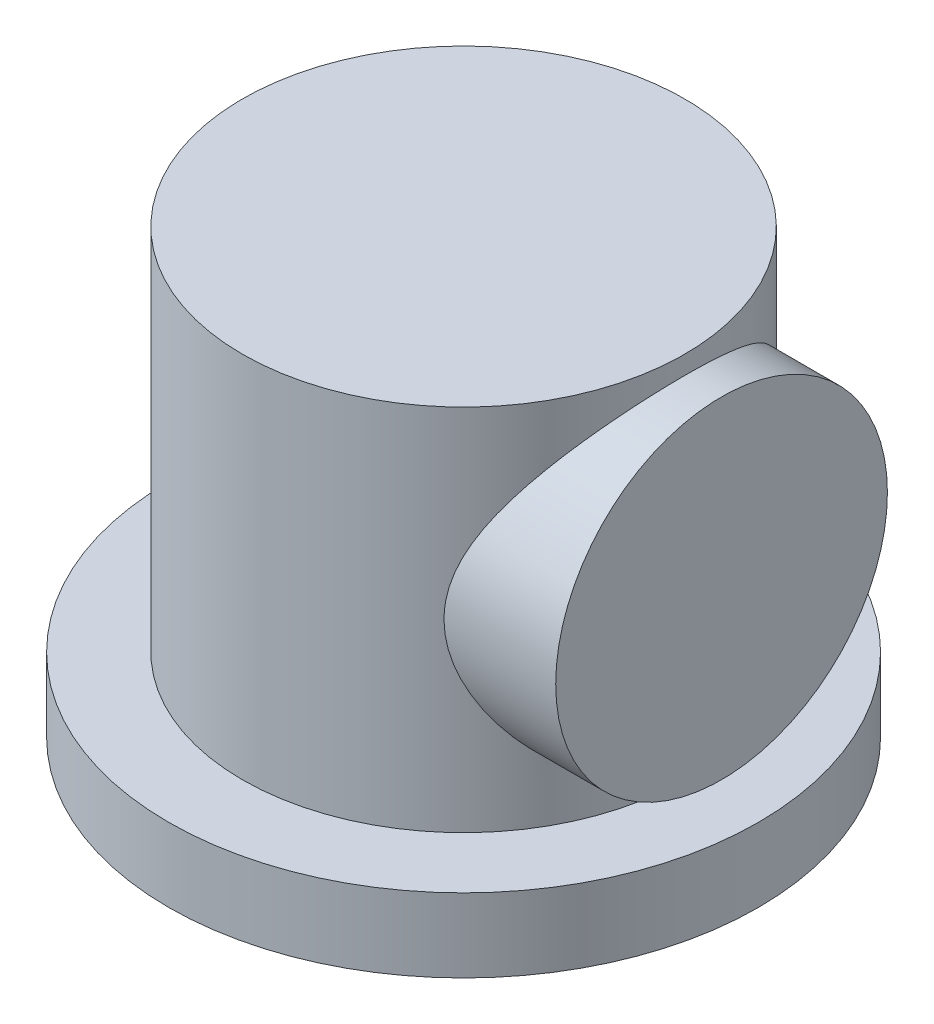
ISO-10303-21;
HEADER;
FILE_DESCRIPTION(('STEP AP214'),'2;1');
FILE_NAME('part.step','',(''),(''),'','','');
FILE_SCHEMA(('AUTOMOTIVE_DESIGN { 1 0 10303 214 1 1 1 1 }'));
ENDSEC;
DATA;
#1=APPLICATION_CONTEXT('core data for automotive mechanical design processes');
#2=APPLICATION_PROTOCOL_DEFINITION('international standard','automotive_design',2000,#1);
#3=PRODUCT_CONTEXT('',#1,'mechanical');
#4=PRODUCT('Part','Part','',(#3));
#5=PRODUCT_RELATED_PRODUCT_CATEGORY('part','',(#4));
#6=PRODUCT_DEFINITION_FORMATION('','',#4);
#7=PRODUCT_DEFINITION_CONTEXT('part definition',#1,'design');
#8=PRODUCT_DEFINITION('design','',#6,#7);
#9=PRODUCT_DEFINITION_SHAPE('','',#8);
#10=(LENGTH_UNIT() NAMED_UNIT(*) SI_UNIT(.MILLI.,.METRE.));
#11=(NAMED_UNIT(*) PLANE_ANGLE_UNIT() SI_UNIT($,.RADIAN.));
#12=(NAMED_UNIT(*) SI_UNIT($,.STERADIAN.) SOLID_ANGLE_UNIT());
#13=UNCERTAINTY_MEASURE_WITH_UNIT(LENGTH_MEASURE(1.E-05),#10,'distance_accuracy_value','');
#14=(GEOMETRIC_REPRESENTATION_CONTEXT(3) GLOBAL_UNCERTAINTY_ASSIGNED_CONTEXT((#13)) GLOBAL_UNIT_ASSIGNED_CONTEXT((#10,
#11,#12)) REPRESENTATION_CONTEXT('',''));
#15=CARTESIAN_POINT('',(0.,0.,0.));
#16=DIRECTION('',(0.,0.,1.));
#17=DIRECTION('',(1.,0.,0.));
#18=AXIS2_PLACEMENT_3D('',#15,#16,#17);
#19=CARTESIAN_POINT('',(0.,76.2,0.));
#20=DIRECTION('',(0.,-1.,0.));
#21=DIRECTION('',(0.,0.,-1.));
#22=AXIS2_PLACEMENT_3D('',#19,#20,#21);
#23=CYLINDRICAL_SURFACE('',#22,38.1);
#24=CARTESIAN_POINT('',(0.,76.2,0.));
#25=DIRECTION('',(0.,1.,0.));
#26=DIRECTION('',(0.,0.,1.));
#27=AXIS2_PLACEMENT_3D('',#24,#25,#26);
#28=CIRCLE('',#27,38.1);
#29=CARTESIAN_POINT('',(0.,76.2,38.1));
#30=VERTEX_POINT('',#29);
#31=EDGE_CURVE('E55',#30,#30,#28,.T.);
#32=ORIENTED_EDGE('',*,*,#31,.F.);
#33=EDGE_LOOP('',(#32));
#34=FACE_BOUND('',#33,.T.);
#35=CARTESIAN_POINT('',(0.,12.7,0.));
#36=DIRECTION('',(0.,1.,0.));
#37=DIRECTION('',(0.,0.,1.));
#38=AXIS2_PLACEMENT_3D('',#35,#36,#37);
#39=CIRCLE('',#38,38.1);
#40=CARTESIAN_POINT('',(0.,12.7,38.1));
#41=VERTEX_POINT('',#40);
#42=EDGE_CURVE('E43',#41,#41,#39,.T.);
#43=ORIENTED_EDGE('',*,*,#42,.T.);
#44=EDGE_LOOP('',(#43));
#45=FACE_BOUND('',#44,.T.);
#46=CARTESIAN_POINT('',(25.2007812378902,44.45,28.575));
#47=CARTESIAN_POINT('',(25.2008006671409,43.7830980894137,28.5749906044805));
#48=CARTESIAN_POINT('',(25.227408448482,43.1160504750004,28.5515850524145));
#49=CARTESIAN_POINT('',(25.3322147950642,41.7892026037153,28.458628921137));
#50=CARTESIAN_POINT('',(25.4104305730004,41.1294048395383,28.3890629461029));
#51=CARTESIAN_POINT('',(25.6140600755985,39.8219380686883,28.2054717153486));
#52=CARTESIAN_POINT('',(25.7395852830767,39.1743015337192,28.0913414224956));
#53=CARTESIAN_POINT('',(26.0313832344784,37.8971025459034,27.8211510872177));
#54=CARTESIAN_POINT('',(26.1976677884626,37.2675453907448,27.6650788908199));
#55=CARTESIAN_POINT('',(26.4708904185141,36.3435992164623,27.402875206737));
#56=CARTESIAN_POINT('',(26.5651796298396,36.0410910363347,27.311536282414));
#57=CARTESIAN_POINT('',(26.7610163164268,35.4415132303561,27.1196755900328));
#58=CARTESIAN_POINT('',(26.8625610863404,35.1444416287561,27.0191572408189));
#59=CARTESIAN_POINT('',(27.1768993304153,34.2614169479612,26.7041954914019));
#60=CARTESIAN_POINT('',(27.3994022547113,33.6836356591392,26.4763401576649));
#61=CARTESIAN_POINT('',(27.8639216060738,32.5510281620977,25.9870283566228));
#62=CARTESIAN_POINT('',(28.1059314529202,31.996194307849,25.7255832025565));
#63=CARTESIAN_POINT('',(28.6040760158201,30.9094323185685,25.1705370121982));
#64=CARTESIAN_POINT('',(28.8602117558184,30.3775058490164,24.8769336433261));
#65=CARTESIAN_POINT('',(29.4363988945169,29.2276774439548,24.1939571622755));
#66=CARTESIAN_POINT('',(29.7585993568103,28.6151081581173,23.7974062407674));
#67=CARTESIAN_POINT('',(30.4090601561974,27.4241287463294,22.9604032544577));
#68=CARTESIAN_POINT('',(30.7373209899645,26.8457214365579,22.5199475783428));
#69=CARTESIAN_POINT('',(31.3937545345196,25.7231205020728,21.5954630489136));
#70=CARTESIAN_POINT('',(31.721926474217,25.1789760639336,21.1113738748122));
#71=CARTESIAN_POINT('',(32.3716808774726,24.1271733614063,20.1008754774065));
#72=CARTESIAN_POINT('',(32.6932627916492,23.6195181301891,19.5744627436374));
#73=CARTESIAN_POINT('',(33.3886679843566,22.5427942500873,18.3680608231992));
#74=CARTESIAN_POINT('',(33.7597234755502,21.9824014553537,17.6786819186663));
#75=CARTESIAN_POINT('',(34.4744224683798,20.9221512415051,16.240948491866));
#76=CARTESIAN_POINT('',(34.8180597996023,20.4223074358014,15.4925807691664));
#77=CARTESIAN_POINT('',(35.3052806236729,19.7232700666945,14.3291250333514));
#78=CARTESIAN_POINT('',(35.4628696732549,19.4988677664602,13.9348128159413));
#79=CARTESIAN_POINT('',(35.7676348392876,19.0675721259238,13.1327919340335));
#80=CARTESIAN_POINT('',(35.9148115905115,18.8606777181229,12.725084088407));
#81=CARTESIAN_POINT('',(36.1975011282807,18.465412737829,11.8971488411912));
#82=CARTESIAN_POINT('',(36.3330205609467,18.2770316016226,11.4769287595878));
#83=CARTESIAN_POINT('',(36.591386652846,17.9195371298192,10.6244474996037));
#84=CARTESIAN_POINT('',(36.7142302916224,17.7504283855541,10.1921834823495));
#85=CARTESIAN_POINT('',(36.9920391771516,17.3694772639004,9.14322050929647));
#86=CARTESIAN_POINT('',(37.1404683694886,17.167220637446,8.52125272848172));
#87=CARTESIAN_POINT('',(37.4076309332702,16.8046298428865,7.25914303206016));
#88=CARTESIAN_POINT('',(37.5263713869622,16.6442856761504,6.61900549149916));
#89=CARTESIAN_POINT('',(37.7317822532989,16.3676817121018,5.32462507705733));
#90=CARTESIAN_POINT('',(37.8184740717763,16.2513924884477,4.67039192807618));
#91=CARTESIAN_POINT('',(37.9580664020574,16.0644526077052,3.35182184474573));
#92=CARTESIAN_POINT('',(38.0109657025718,15.9938035865842,2.68748454908811));
#93=CARTESIAN_POINT('',(38.0818960471386,15.8991257178152,1.3518710468347));
#94=CARTESIAN_POINT('',(38.0998353574208,15.8752195211318,0.680581219013222));
#95=CARTESIAN_POINT('',(38.1001623818557,15.8747834931662,-0.662019585113726));
#96=CARTESIAN_POINT('',(38.0825502366907,15.8982534744097,-1.333330561325));
#97=CARTESIAN_POINT('',(38.0121671928184,15.9921988987437,-2.67091462091919));
#98=CARTESIAN_POINT('',(37.9593893441283,16.0626836336099,-3.33718668210466));
#99=CARTESIAN_POINT('',(37.8198364811661,16.2495653359708,-4.6596210134355));
#100=CARTESIAN_POINT('',(37.7330616925311,16.3659619987485,-5.31578335064894));
#101=CARTESIAN_POINT('',(37.5309020208181,16.6381817567608,-6.5912007013435));
#102=CARTESIAN_POINT('',(37.4166034046182,16.7925116750831,-7.21094899468921));
#103=CARTESIAN_POINT('',(37.160171322655,17.1404270179622,-8.43336854480208));
#104=CARTESIAN_POINT('',(37.0180386949086,17.3340112606693,-9.0360403150782));
#105=CARTESIAN_POINT('',(36.7083984634839,17.7582752021408,-10.2214897432997));
#106=CARTESIAN_POINT('',(36.5408885876569,17.9889582226536,-10.8042656141374));
#107=CARTESIAN_POINT('',(36.183199601535,18.4851368929411,-11.9475913883163));
#108=CARTESIAN_POINT('',(35.9930191498547,18.7506346027439,-12.5081399738835));
#109=CARTESIAN_POINT('',(35.571151295106,19.3447055761846,-13.6646224776035));
#110=CARTESIAN_POINT('',(35.3371993200098,19.6769954998992,-14.2578206141072));
#111=CARTESIAN_POINT('',(34.848864743216,20.3786999325388,-15.4129800377948));
#112=CARTESIAN_POINT('',(34.5944808958504,20.7481167053182,-15.9749394169088));
#113=CARTESIAN_POINT('',(34.0690818416613,21.5217712654444,-17.0667789463111));
#114=CARTESIAN_POINT('',(33.7980552583958,21.9260329496009,-17.5966366501525));
#115=CARTESIAN_POINT('',(33.2435454371908,22.7669684661831,-18.623023428057));
#116=CARTESIAN_POINT('',(32.9600616087754,23.2036438357015,-19.1195509194357));
#117=CARTESIAN_POINT('',(32.3280797016931,24.1966130786345,-20.1730776954288));
#118=CARTESIAN_POINT('',(31.9777641620642,24.7595376357236,-20.7227531516277));
#119=CARTESIAN_POINT('',(31.2723590801129,25.9271061891218,-21.7726808371495));
#120=CARTESIAN_POINT('',(30.9172686294436,26.5317582164321,-22.2729235071738));
#121=CARTESIAN_POINT('',(30.2100659592312,27.7816326102999,-23.2231089145585));
#122=CARTESIAN_POINT('',(29.8579554140302,28.4268762632745,-23.6730249110129));
#123=CARTESIAN_POINT('',(29.1658356330383,29.7568347447342,-24.52066856255));
#124=CARTESIAN_POINT('',(28.8258237062776,30.4415407061441,-24.9184078762976));
#125=CARTESIAN_POINT('',(28.2330584080281,31.7112403258947,-25.5863782679948));
#126=CARTESIAN_POINT('',(27.9763151422166,32.2892881082254,-25.8662897768244));
#127=CARTESIAN_POINT('',(27.4834916409928,33.4704295168007,-26.3893303191345));
#128=CARTESIAN_POINT('',(27.2474111712708,34.0735228589217,-26.6324597697351));
#129=CARTESIAN_POINT('',(26.8033817097847,35.3028834011413,-27.0792874467679));
#130=CARTESIAN_POINT('',(26.5953812416905,35.9291054407557,-27.2830581296517));
#131=CARTESIAN_POINT('',(26.2147449382644,37.2040962989309,-27.6489960172601));
#132=CARTESIAN_POINT('',(26.0420998844247,37.8528591884964,-27.8111740695632));
#133=CARTESIAN_POINT('',(25.7699617403444,39.0392964190427,-28.0632559394245));
#134=CARTESIAN_POINT('',(25.6627523563713,39.5735143773936,-28.1611130078221));
#135=CARTESIAN_POINT('',(25.4798439875616,40.6519446652572,-28.3267161168432));
#136=CARTESIAN_POINT('',(25.4041409692325,41.1961557061205,-28.3944660119079));
#137=CARTESIAN_POINT('',(25.2872757496332,42.2906909142761,-28.4985939420604));
#138=CARTESIAN_POINT('',(25.2460760717413,42.8410077892892,-28.5350060166583));
#139=CARTESIAN_POINT('',(25.1998268478469,43.9443714114327,-28.5758587892175));
#140=CARTESIAN_POINT('',(25.1947776736046,44.497418186578,-28.5802991583918));
#141=CARTESIAN_POINT('',(25.2210575813258,45.6021419430101,-28.5571102643138));
#142=CARTESIAN_POINT('',(25.2523986371663,46.1538184135396,-28.5294704453661));
#143=CARTESIAN_POINT('',(25.3501258083572,47.2515095528914,-28.4426676566597));
#144=CARTESIAN_POINT('',(25.4165119638612,47.7975242152258,-28.3835046507828));
#145=CARTESIAN_POINT('',(25.5817776566982,48.8811675230324,-28.2346413415518));
#146=CARTESIAN_POINT('',(25.6807046181691,49.4187827223068,-28.1448964620532));
#147=CARTESIAN_POINT('',(25.9074459324733,50.482116208448,-27.936318955934));
#148=CARTESIAN_POINT('',(26.0352643679854,51.007832802351,-27.8174822181209));
#149=CARTESIAN_POINT('',(26.3683068237936,52.2397000456342,-27.5025947417635));
#150=CARTESIAN_POINT('',(26.5845974013906,52.9397465155155,-27.2942911989163));
#151=CARTESIAN_POINT('',(27.0536964284258,54.3109773250914,-26.8293952509529));
#152=CARTESIAN_POINT('',(27.3065196233281,54.9821498679216,-26.5727833346621));
#153=CARTESIAN_POINT('',(27.8393177875196,56.295202175688,-26.014064987654));
#154=CARTESIAN_POINT('',(28.1193300724408,56.9370398524956,-25.711895708448));
#155=CARTESIAN_POINT('',(28.697672043654,58.1899353706702,-25.0647551327964));
#156=CARTESIAN_POINT('',(28.9960000742872,58.8009959850783,-24.719787702237));
#157=CARTESIAN_POINT('',(29.6144541218864,60.013351260662,-23.9757453989122));
#158=CARTESIAN_POINT('',(29.9349779962601,60.6135294170108,-23.5751846107589));
#159=CARTESIAN_POINT('',(30.5807447831745,61.7802790183083,-22.7312652262108));
#160=CARTESIAN_POINT('',(30.9059877139457,62.3468503333849,-22.2879064644426));
#161=CARTESIAN_POINT('',(31.5550533275042,63.4457525561561,-21.359067681462));
#162=CARTESIAN_POINT('',(31.8788753223944,63.9780682879549,-20.8735692122151));
#163=CARTESIAN_POINT('',(32.5191971732612,65.0067697574724,-19.8612839097829));
#164=CARTESIAN_POINT('',(32.8356961941858,65.5031514111683,-19.334492397638));
#165=CARTESIAN_POINT('',(33.5236633778671,66.5622682087661,-18.120737631263));
#166=CARTESIAN_POINT('',(33.8920300148216,67.1157997664435,-17.4239286669213));
#167=CARTESIAN_POINT('',(34.6001723875726,68.1616116517594,-15.9715532122372));
#168=CARTESIAN_POINT('',(34.9399416276979,68.6538780755995,-15.215973447165));
#169=CARTESIAN_POINT('',(35.4205126331983,69.3409609007818,-14.0419384618341));
#170=CARTESIAN_POINT('',(35.5757605447957,69.5613038642579,-13.6440989647438));
#171=CARTESIAN_POINT('',(35.8755471226629,69.9842474446731,-12.8351501300233));
#172=CARTESIAN_POINT('',(36.0200864378376,70.1868491368093,-12.4240415986229));
#173=CARTESIAN_POINT('',(36.2972079248044,70.5732854940932,-11.5894740991166));
#174=CARTESIAN_POINT('',(36.4297970290804,70.7571310482128,-11.1660224825795));
#175=CARTESIAN_POINT('',(36.6820161901599,71.1053059444489,-10.307281125119));
#176=CARTESIAN_POINT('',(36.8016431702679,71.2696306539771,-9.87198860417361));
#177=CARTESIAN_POINT('',(37.0707510022335,71.6379136123436,-8.81866960573876));
#178=CARTESIAN_POINT('',(37.2136812612396,71.8323374705853,-8.19558077388393));
#179=CARTESIAN_POINT('',(37.4696312736205,72.1791828421449,-6.9319712036336));
#180=CARTESIAN_POINT('',(37.582658152192,72.3316143615013,-6.29145465799526));
#181=CARTESIAN_POINT('',(37.7765317652544,72.5923983913291,-4.99714558537468));
#182=CARTESIAN_POINT('',(37.8574009801015,72.7007816956188,-4.34336266969851));
#183=CARTESIAN_POINT('',(37.9853608830268,72.8720250729473,-3.02654051638908));
#184=CARTESIAN_POINT('',(38.0324503090071,72.9348834450609,-2.36350093384694));
#185=CARTESIAN_POINT('',(38.0918815910372,73.0141867248548,-1.03150939231245));
#186=CARTESIAN_POINT('',(38.1041410569545,73.0305215815697,-0.362547163149573));
#187=CARTESIAN_POINT('',(38.0934009635031,73.0162010712598,0.974584776825553));
#188=CARTESIAN_POINT('',(38.0704015563487,72.9855459070934,1.64275449104667));
#189=CARTESIAN_POINT('',(37.9896511547263,72.8777239984574,2.97334578822651));
#190=CARTESIAN_POINT('',(37.9318923226539,72.8005467641189,3.63576604060609));
#191=CARTESIAN_POINT('',(37.7828788790066,72.6008609893126,4.94988605348683));
#192=CARTESIAN_POINT('',(37.6916243593539,72.4783525732472,5.60158584340306));
#193=CARTESIAN_POINT('',(37.4806559201503,72.1939903159403,6.87112976387685));
#194=CARTESIAN_POINT('',(37.361849490476,72.0333879837893,7.48940697907806));
#195=CARTESIAN_POINT('',(37.0966781359524,71.6731338570981,8.70836026530636));
#196=CARTESIAN_POINT('',(36.9503139386871,71.4734830935146,9.30903680054534));
#197=CARTESIAN_POINT('',(36.6325398006887,71.0373261194736,10.4900448847782));
#198=CARTESIAN_POINT('',(36.4611277921452,70.8008168660734,11.0703747491531));
#199=CARTESIAN_POINT('',(36.096000457449,70.2932379661335,12.2084383688182));
#200=CARTESIAN_POINT('',(35.9022838073255,70.022166267915,12.7661707800975));
#201=CARTESIAN_POINT('',(35.4723542826504,69.4151664431619,13.9191318420988));
#202=CARTESIAN_POINT('',(35.2338132072728,69.0753700446308,14.5114555432581));
#203=CARTESIAN_POINT('',(34.7366428355887,68.3586099987138,15.6642844007251));
#204=CARTESIAN_POINT('',(34.4780122485344,67.9816439627651,16.2247875085538));
#205=CARTESIAN_POINT('',(33.9445167787726,67.1928088003313,17.313213651702));
#206=CARTESIAN_POINT('',(33.6696397151148,66.7809133819837,17.8411116187321));
#207=CARTESIAN_POINT('',(33.107926098622,65.9246318834989,18.8630666720214));
#208=CARTESIAN_POINT('',(32.8210889947595,65.4802443056579,19.3571221963008));
#209=CARTESIAN_POINT('',(32.1820637195896,64.4696936948026,20.4052003940917));
#210=CARTESIAN_POINT('',(31.8281746713873,63.896833559878,20.9517459761954));
#211=CARTESIAN_POINT('',(31.116657070217,62.7090591227848,21.9945944624509));
#212=CARTESIAN_POINT('',(30.7590277689508,62.0941362634682,22.4908870920128));
#213=CARTESIAN_POINT('',(30.0481031765867,60.8233544432968,23.4322315541246));
#214=CARTESIAN_POINT('',(29.6948098892338,60.1674773503969,23.8772604385744));
#215=CARTESIAN_POINT('',(29.002042203453,58.8157895176872,24.7140922348366));
#216=CARTESIAN_POINT('',(28.6625642514762,58.119989159242,25.1059088951554));
#217=CARTESIAN_POINT('',(28.0789217398268,56.8433524068337,25.7552239445342));
#218=CARTESIAN_POINT('',(27.8300049190275,56.2701352994716,26.0234566947948));
#219=CARTESIAN_POINT('',(27.3533683904451,55.0995596199978,26.5240010004198));
#220=CARTESIAN_POINT('',(27.125648736245,54.5022009868654,26.7563124649817));
#221=CARTESIAN_POINT('',(26.6987309826621,53.2855292647425,27.1823207032823));
#222=CARTESIAN_POINT('',(26.4994705336959,52.666267996459,27.3761022671336));
#223=CARTESIAN_POINT('',(26.1363167517498,51.4063587870439,27.7230256458686));
#224=CARTESIAN_POINT('',(25.9724110557796,50.7657184126256,27.8761816711697));
#225=CARTESIAN_POINT('',(25.7291435243572,49.6567647578768,28.100532362723));
#226=CARTESIAN_POINT('',(25.6390820228776,49.1929675901616,28.1825930465279));
#227=CARTESIAN_POINT('',(25.4826989304928,48.2579965584536,28.3240748092664));
#228=CARTESIAN_POINT('',(25.4163731859204,47.7868240002037,28.3834998494687));
#229=CARTESIAN_POINT('',(25.309433654443,46.8394295539965,28.4789000325863));
#230=CARTESIAN_POINT('',(25.268806636773,46.3632103928566,28.5148872425468));
#231=CARTESIAN_POINT('',(25.2144723813682,45.4080193582836,28.5629415505675));
#232=CARTESIAN_POINT('',(25.2007672815208,44.9290472692675,28.5750067489655));
#233=CARTESIAN_POINT('',(25.2007812378902,44.45,28.575));
#234=B_SPLINE_CURVE_WITH_KNOTS('',3,(#46,#47,#48,#49,#50,#51,#52,#53,#54,#55,#56,#57,#58,#59,
#60,#61,#62,#63,#64,#65,#66,#67,#68,#69,#70,#71,#72,#73,#74,#75,#76,#77,#78,#79,#80,#81,#82,#83,
#84,#85,#86,#87,#88,#89,#90,#91,#92,#93,#94,#95,#96,#97,#98,#99,#100,#101,#102,#103,#104,#105,
#106,#107,#108,#109,#110,#111,#112,#113,#114,#115,#116,#117,#118,#119,#120,#121,#122,#123,#124,
#125,#126,#127,#128,#129,#130,#131,#132,#133,#134,#135,#136,#137,#138,#139,#140,#141,#142,#143,
#144,#145,#146,#147,#148,#149,#150,#151,#152,#153,#154,#155,#156,#157,#158,#159,#160,#161,#162,
#163,#164,#165,#166,#167,#168,#169,#170,#171,#172,#173,#174,#175,#176,#177,#178,#179,#180,#181,
#182,#183,#184,#185,#186,#187,#188,#189,#190,#191,#192,#193,#194,#195,#196,#197,#198,#199,#200,
#201,#202,#203,#204,#205,#206,#207,#208,#209,#210,#211,#212,#213,#214,#215,#216,#217,#218,#219,
#220,#221,#222,#223,#224,#225,#226,#227,#228,#229,#230,#231,#232,#233),.UNSPECIFIED.,.T.,.F.,(4,
2,2,2,2,2,2,2,2,2,2,2,2,2,2,2,2,2,2,2,2,2,2,2,2,2,2,2,2,2,2,2,2,2,2,2,2,2,2,2,2,2,2,2,2,2,2,2,2,
2,2,2,2,2,2,2,2,2,2,2,2,2,2,2,2,2,2,2,2,2,2,2,2,2,2,2,2,2,2,2,2,2,2,2,2,2,2,2,2,2,2,2,2,4),(0.,
2.00004675291555,4.00076091420471,6.00621946031262,8.01225977832434,9.00134321573287,
9.99005976336025,11.9674334740813,13.9441429316912,15.9209958640068,18.3119723957321,
20.7031457558301,23.0976770168879,25.4924070940824,28.3769352830505,31.2621108101709,
32.7024516311165,34.1427045676232,35.5821308620655,37.0218993625608,39.0316474355142,
41.0409156247569,43.0488393542511,45.0568350535236,47.0700926051723,49.0833421900824,
51.0969897821533,53.1106240098953,55.0550245203894,56.9993664985332,58.9438826660918,
60.8885139450376,63.043599539453,65.1988166226391,67.3555237069682,69.512333130146,
72.0935075205188,74.675180084874,77.258217960544,79.8406776803506,81.9141431922989,
83.9875851887341,86.0571729776601,88.1262204569569,89.7853438983742,91.4442548709145,
93.1013616323437,94.7584854349097,96.4161546536771,98.0738257717572,99.7339235208149,
101.39425600652,103.675953497535,105.958574523744,108.244373842931,110.529966839767,
112.896686533781,115.26341537329,117.631185602675,119.999224515594,122.884734137417,
125.770897420887,127.212029163229,128.653073506279,130.093276425109,131.533820445721,
133.53613892851,135.537979880393,137.538418941058,139.538932739263,141.544174820654,
143.549408245337,145.555093982399,147.560774215292,149.507967652069,151.455109685975,
153.402412556181,155.349831075078,157.517754546462,159.685817421956,161.855526967375,
164.025336587188,166.624474656091,169.224143069606,171.824970733238,174.425125134256,
176.463810935917,178.502501890922,180.53665553729,182.570096715442,184.007643364789,
185.444938325792,186.881492704473,188.318161156284),.UNSPECIFIED.);
#235=CARTESIAN_POINT('',(25.2007812378902,44.45,28.575));
#236=VERTEX_POINT('',#235);
#237=EDGE_CURVE('E10',#236,#236,#234,.T.);
#238=ORIENTED_EDGE('',*,*,#237,.F.);
#239=EDGE_LOOP('',(#238));
#240=FACE_BOUND('',#239,.T.);
#241=ADVANCED_FACE('F31',(#34,#45,#240),#23,.T.);
#242=CARTESIAN_POINT('',(0.,12.7,0.));
#243=DIRECTION('',(0.,-1.,0.));
#244=DIRECTION('',(0.,0.,-1.));
#245=AXIS2_PLACEMENT_3D('',#242,#243,#244);
#246=CYLINDRICAL_SURFACE('',#245,50.8);
#247=CARTESIAN_POINT('',(0.,12.7,0.));
#248=DIRECTION('',(0.,1.,0.));
#249=DIRECTION('',(0.,0.,1.));
#250=AXIS2_PLACEMENT_3D('',#247,#248,#249);
#251=CIRCLE('',#250,50.8);
#252=CARTESIAN_POINT('',(0.,12.7,50.8));
#253=VERTEX_POINT('',#252);
#254=EDGE_CURVE('E47',#253,#253,#251,.T.);
#255=ORIENTED_EDGE('',*,*,#254,.F.);
#256=EDGE_LOOP('',(#255));
#257=FACE_BOUND('',#256,.T.);
#258=CARTESIAN_POINT('',(0.,0.,0.));
#259=DIRECTION('',(0.,1.,0.));
#260=DIRECTION('',(0.,0.,1.));
#261=AXIS2_PLACEMENT_3D('',#258,#259,#260);
#262=CIRCLE('',#261,50.8);
#263=CARTESIAN_POINT('',(0.,0.,50.8));
#264=VERTEX_POINT('',#263);
#265=EDGE_CURVE('E52',#264,#264,#262,.T.);
#266=ORIENTED_EDGE('',*,*,#265,.T.);
#267=EDGE_LOOP('',(#266));
#268=FACE_BOUND('',#267,.T.);
#269=ADVANCED_FACE('F33',(#257,#268),#246,.T.);
#270=CARTESIAN_POINT('',(0.,12.7,0.));
#271=DIRECTION('',(0.,1.,0.));
#272=DIRECTION('',(0.,0.,1.));
#273=AXIS2_PLACEMENT_3D('',#270,#271,#272);
#274=PLANE('',#273);
#275=ORIENTED_EDGE('',*,*,#42,.F.);
#276=EDGE_LOOP('',(#275));
#277=FACE_BOUND('',#276,.T.);
#278=ORIENTED_EDGE('',*,*,#254,.T.);
#279=EDGE_LOOP('',(#278));
#280=FACE_BOUND('',#279,.T.);
#281=ADVANCED_FACE('F85',(#277,#280),#274,.T.);
#282=CARTESIAN_POINT('',(0.,0.,0.));
#283=DIRECTION('',(0.,1.,0.));
#284=DIRECTION('',(0.,0.,1.));
#285=AXIS2_PLACEMENT_3D('',#282,#283,#284);
#286=PLANE('',#285);
#287=ORIENTED_EDGE('',*,*,#265,.F.);
#288=EDGE_LOOP('',(#287));
#289=FACE_BOUND('',#288,.T.);
#290=ADVANCED_FACE('F77',(#289),#286,.F.);
#291=CARTESIAN_POINT('',(0.,76.2,0.));
#292=DIRECTION('',(0.,1.,0.));
#293=DIRECTION('',(0.,0.,1.));
#294=AXIS2_PLACEMENT_3D('',#291,#292,#293);
#295=PLANE('',#294);
#296=ORIENTED_EDGE('',*,*,#31,.T.);
#297=EDGE_LOOP('',(#296));
#298=FACE_BOUND('',#297,.T.);
#299=ADVANCED_FACE('F71',(#298),#295,.T.);
#300=CARTESIAN_POINT('',(44.45,44.45,0.));
#301=DIRECTION('',(-1.,0.,0.));
#302=DIRECTION('',(0.,0.,1.));
#303=AXIS2_PLACEMENT_3D('',#300,#301,#302);
#304=CYLINDRICAL_SURFACE('',#303,28.575);
#305=CARTESIAN_POINT('',(44.45,44.45,0.));
#306=DIRECTION('',(1.,0.,0.));
#307=DIRECTION('',(0.,0.,-1.));
#308=AXIS2_PLACEMENT_3D('',#305,#306,#307);
#309=CIRCLE('',#308,28.575);
#310=CARTESIAN_POINT('',(44.45,44.45,-28.575));
#311=VERTEX_POINT('',#310);
#312=EDGE_CURVE('E61',#311,#311,#309,.T.);
#313=ORIENTED_EDGE('',*,*,#312,.F.);
#314=EDGE_LOOP('',(#313));
#315=FACE_BOUND('',#314,.T.);
#316=ORIENTED_EDGE('',*,*,#237,.T.);
#317=EDGE_LOOP('',(#316));
#318=FACE_BOUND('',#317,.T.);
#319=ADVANCED_FACE('F69',(#315,#318),#304,.T.);
#320=CARTESIAN_POINT('',(44.45,44.45,0.));
#321=DIRECTION('',(1.,0.,0.));
#322=DIRECTION('',(0.,0.,-1.));
#323=AXIS2_PLACEMENT_3D('',#320,#321,#322);
#324=PLANE('',#323);
#325=ORIENTED_EDGE('',*,*,#312,.T.);
#326=EDGE_LOOP('',(#325));
#327=FACE_BOUND('',#326,.T.);
#328=ADVANCED_FACE('F67',(#327),#324,.T.);
#329=CLOSED_SHELL('',(#241,#269,#281,#290,#299,#319,#328));
#330=MANIFOLD_SOLID_BREP('B2',#329);
#331=ADVANCED_BREP_SHAPE_REPRESENTATION('',(#18,#330),#14);
#332=SHAPE_DEFINITION_REPRESENTATION(#9,#331);
ENDSEC;
END-ISO-10303-21;
